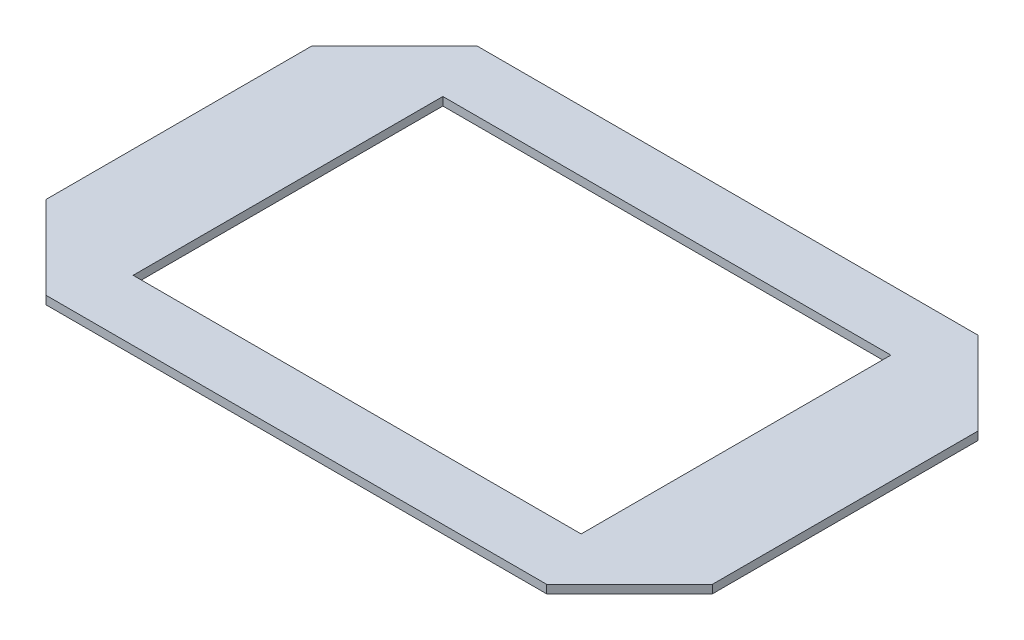
ISO-10303-21;
HEADER;
FILE_DESCRIPTION(('STEP AP214'),'2;1');
FILE_NAME('part.step','',(''),(''),'','','');
FILE_SCHEMA(('AUTOMOTIVE_DESIGN { 1 0 10303 214 1 1 1 1 }'));
ENDSEC;
DATA;
#1=APPLICATION_CONTEXT('core data for automotive mechanical design processes');
#2=APPLICATION_PROTOCOL_DEFINITION('international standard','automotive_design',2000,#1);
#3=PRODUCT_CONTEXT('',#1,'mechanical');
#4=PRODUCT('Part','Part','',(#3));
#5=PRODUCT_RELATED_PRODUCT_CATEGORY('part','',(#4));
#6=PRODUCT_DEFINITION_FORMATION('','',#4);
#7=PRODUCT_DEFINITION_CONTEXT('part definition',#1,'design');
#8=PRODUCT_DEFINITION('design','',#6,#7);
#9=PRODUCT_DEFINITION_SHAPE('','',#8);
#10=(LENGTH_UNIT() NAMED_UNIT(*) SI_UNIT(.MILLI.,.METRE.));
#11=(NAMED_UNIT(*) PLANE_ANGLE_UNIT() SI_UNIT($,.RADIAN.));
#12=(NAMED_UNIT(*) SI_UNIT($,.STERADIAN.) SOLID_ANGLE_UNIT());
#13=UNCERTAINTY_MEASURE_WITH_UNIT(LENGTH_MEASURE(1.E-05),#10,'distance_accuracy_value','');
#14=(GEOMETRIC_REPRESENTATION_CONTEXT(3) GLOBAL_UNCERTAINTY_ASSIGNED_CONTEXT((#13)) GLOBAL_UNIT_ASSIGNED_CONTEXT((#10,
#11,#12)) REPRESENTATION_CONTEXT('',''));
#15=CARTESIAN_POINT('',(0.,0.,0.));
#16=DIRECTION('',(0.,0.,1.));
#17=DIRECTION('',(1.,0.,0.));
#18=AXIS2_PLACEMENT_3D('',#15,#16,#17);
#19=CARTESIAN_POINT('',(60.25,1.5,39.));
#20=DIRECTION('',(-1.,0.,0.));
#21=DIRECTION('',(0.,0.,1.));
#22=AXIS2_PLACEMENT_3D('',#19,#20,#21);
#23=PLANE('',#22);
#24=DIRECTION('',(0.,0.,-1.));
#25=VECTOR('',#24,1.);
#26=CARTESIAN_POINT('',(60.25,0.,39.));
#27=LINE('',#26,#25);
#28=CARTESIAN_POINT('',(60.25,0.,24.));
#29=VERTEX_POINT('',#28);
#30=CARTESIAN_POINT('',(60.25,0.,-23.9999999999999));
#31=VERTEX_POINT('',#30);
#32=EDGE_CURVE('E146',#29,#31,#27,.T.);
#33=ORIENTED_EDGE('',*,*,#32,.T.);
#34=DIRECTION('',(0.,1.,0.));
#35=VECTOR('',#34,1.);
#36=CARTESIAN_POINT('',(60.25,1.5,-23.9999999999999));
#37=LINE('',#36,#35);
#38=CARTESIAN_POINT('',(60.25,1.5,-23.9999999999999));
#39=VERTEX_POINT('',#38);
#40=EDGE_CURVE('E201',#31,#39,#37,.T.);
#41=ORIENTED_EDGE('',*,*,#40,.T.);
#42=DIRECTION('',(0.,0.,-1.));
#43=VECTOR('',#42,1.);
#44=CARTESIAN_POINT('',(60.25,1.5,39.));
#45=LINE('',#44,#43);
#46=CARTESIAN_POINT('',(60.25,1.5,24.));
#47=VERTEX_POINT('',#46);
#48=EDGE_CURVE('E149',#47,#39,#45,.T.);
#49=ORIENTED_EDGE('',*,*,#48,.F.);
#50=DIRECTION('',(0.,-1.,0.));
#51=VECTOR('',#50,1.);
#52=CARTESIAN_POINT('',(60.25,1.5,24.));
#53=LINE('',#52,#51);
#54=EDGE_CURVE('E198',#47,#29,#53,.T.);
#55=ORIENTED_EDGE('',*,*,#54,.T.);
#56=EDGE_LOOP('',(#33,#41,#49,#55));
#57=FACE_BOUND('',#56,.T.);
#58=ADVANCED_FACE('F32',(#57),#23,.F.);
#59=CARTESIAN_POINT('',(-60.25,1.5,-39.));
#60=DIRECTION('',(0.,0.,1.));
#61=DIRECTION('',(1.,0.,0.));
#62=AXIS2_PLACEMENT_3D('',#59,#60,#61);
#63=PLANE('',#62);
#64=DIRECTION('',(-1.,0.,0.));
#65=VECTOR('',#64,1.);
#66=CARTESIAN_POINT('',(-60.25,0.,-39.));
#67=LINE('',#66,#65);
#68=CARTESIAN_POINT('',(45.25,0.,-39.));
#69=VERTEX_POINT('',#68);
#70=CARTESIAN_POINT('',(-45.2499999999999,0.,-39.));
#71=VERTEX_POINT('',#70);
#72=EDGE_CURVE('E165',#69,#71,#67,.T.);
#73=ORIENTED_EDGE('',*,*,#72,.T.);
#74=DIRECTION('',(0.,1.,0.));
#75=VECTOR('',#74,1.);
#76=CARTESIAN_POINT('',(-45.2499999999999,1.5,-39.));
#77=LINE('',#76,#75);
#78=CARTESIAN_POINT('',(-45.2499999999999,1.5,-39.));
#79=VERTEX_POINT('',#78);
#80=EDGE_CURVE('E188',#71,#79,#77,.T.);
#81=ORIENTED_EDGE('',*,*,#80,.T.);
#82=DIRECTION('',(-1.,0.,0.));
#83=VECTOR('',#82,1.);
#84=CARTESIAN_POINT('',(-60.25,1.5,-39.));
#85=LINE('',#84,#83);
#86=CARTESIAN_POINT('',(45.25,1.5,-39.));
#87=VERTEX_POINT('',#86);
#88=EDGE_CURVE('E152',#87,#79,#85,.T.);
#89=ORIENTED_EDGE('',*,*,#88,.F.);
#90=DIRECTION('',(0.,-1.,0.));
#91=VECTOR('',#90,1.);
#92=CARTESIAN_POINT('',(45.25,1.5,-39.));
#93=LINE('',#92,#91);
#94=EDGE_CURVE('E185',#87,#69,#93,.T.);
#95=ORIENTED_EDGE('',*,*,#94,.T.);
#96=EDGE_LOOP('',(#73,#81,#89,#95));
#97=FACE_BOUND('',#96,.T.);
#98=ADVANCED_FACE('F231',(#97),#63,.F.);
#99=CARTESIAN_POINT('',(-60.25,1.5,39.));
#100=DIRECTION('',(1.,0.,0.));
#101=DIRECTION('',(0.,0.,-1.));
#102=AXIS2_PLACEMENT_3D('',#99,#100,#101);
#103=PLANE('',#102);
#104=DIRECTION('',(0.,0.,1.));
#105=VECTOR('',#104,1.);
#106=CARTESIAN_POINT('',(-60.25,1.5,39.));
#107=LINE('',#106,#105);
#108=CARTESIAN_POINT('',(-60.25,1.5,-24.));
#109=VERTEX_POINT('',#108);
#110=CARTESIAN_POINT('',(-60.25,1.5,23.9999999999999));
#111=VERTEX_POINT('',#110);
#112=EDGE_CURVE('E156',#109,#111,#107,.T.);
#113=ORIENTED_EDGE('',*,*,#112,.F.);
#114=DIRECTION('',(0.,-1.,0.));
#115=VECTOR('',#114,1.);
#116=CARTESIAN_POINT('',(-60.25,1.5,-24.));
#117=LINE('',#116,#115);
#118=CARTESIAN_POINT('',(-60.25,0.,-24.));
#119=VERTEX_POINT('',#118);
#120=EDGE_CURVE('E174',#109,#119,#117,.T.);
#121=ORIENTED_EDGE('',*,*,#120,.T.);
#122=DIRECTION('',(0.,0.,1.));
#123=VECTOR('',#122,1.);
#124=CARTESIAN_POINT('',(-60.25,0.,39.));
#125=LINE('',#124,#123);
#126=CARTESIAN_POINT('',(-60.25,0.,23.9999999999999));
#127=VERTEX_POINT('',#126);
#128=EDGE_CURVE('E168',#119,#127,#125,.T.);
#129=ORIENTED_EDGE('',*,*,#128,.T.);
#130=DIRECTION('',(0.,1.,0.));
#131=VECTOR('',#130,1.);
#132=CARTESIAN_POINT('',(-60.25,1.5,23.9999999999999));
#133=LINE('',#132,#131);
#134=EDGE_CURVE('E162',#127,#111,#133,.T.);
#135=ORIENTED_EDGE('',*,*,#134,.T.);
#136=EDGE_LOOP('',(#113,#121,#129,#135));
#137=FACE_BOUND('',#136,.T.);
#138=ADVANCED_FACE('F237',(#137),#103,.F.);
#139=CARTESIAN_POINT('',(-60.25,1.5,39.));
#140=DIRECTION('',(0.,0.,-1.));
#141=DIRECTION('',(-1.,0.,0.));
#142=AXIS2_PLACEMENT_3D('',#139,#140,#141);
#143=PLANE('',#142);
#144=DIRECTION('',(1.,0.,0.));
#145=VECTOR('',#144,1.);
#146=CARTESIAN_POINT('',(-60.25,0.,39.));
#147=LINE('',#146,#145);
#148=CARTESIAN_POINT('',(-45.25,0.,39.));
#149=VERTEX_POINT('',#148);
#150=CARTESIAN_POINT('',(45.2499999999999,0.,39.));
#151=VERTEX_POINT('',#150);
#152=EDGE_CURVE('E153',#149,#151,#147,.T.);
#153=ORIENTED_EDGE('',*,*,#152,.T.);
#154=DIRECTION('',(0.,1.,0.));
#155=VECTOR('',#154,1.);
#156=CARTESIAN_POINT('',(45.2499999999999,1.5,39.));
#157=LINE('',#156,#155);
#158=CARTESIAN_POINT('',(45.2499999999999,1.5,39.));
#159=VERTEX_POINT('',#158);
#160=EDGE_CURVE('E206',#151,#159,#157,.T.);
#161=ORIENTED_EDGE('',*,*,#160,.T.);
#162=DIRECTION('',(1.,0.,0.));
#163=VECTOR('',#162,1.);
#164=CARTESIAN_POINT('',(-60.25,1.5,39.));
#165=LINE('',#164,#163);
#166=CARTESIAN_POINT('',(-45.25,1.5,39.));
#167=VERTEX_POINT('',#166);
#168=EDGE_CURVE('E159',#167,#159,#165,.T.);
#169=ORIENTED_EDGE('',*,*,#168,.F.);
#170=DIRECTION('',(0.,-1.,0.));
#171=VECTOR('',#170,1.);
#172=CARTESIAN_POINT('',(-45.25,1.5,39.));
#173=LINE('',#172,#171);
#174=EDGE_CURVE('E203',#167,#149,#173,.T.);
#175=ORIENTED_EDGE('',*,*,#174,.T.);
#176=EDGE_LOOP('',(#153,#161,#169,#175));
#177=FACE_BOUND('',#176,.T.);
#178=ADVANCED_FACE('F274',(#177),#143,.F.);
#179=CARTESIAN_POINT('',(0.,1.5,0.));
#180=DIRECTION('',(0.,-1.,0.));
#181=DIRECTION('',(0.,0.,-1.));
#182=AXIS2_PLACEMENT_3D('',#179,#180,#181);
#183=PLANE('',#182);
#184=DIRECTION('',(-1.,0.,0.));
#185=VECTOR('',#184,1.);
#186=CARTESIAN_POINT('',(-40.5,1.5,-28.));
#187=LINE('',#186,#185);
#188=CARTESIAN_POINT('',(40.5,1.5,-28.));
#189=VERTEX_POINT('',#188);
#190=CARTESIAN_POINT('',(-40.5,1.5,-28.));
#191=VERTEX_POINT('',#190);
#192=EDGE_CURVE('E132',#189,#191,#187,.T.);
#193=ORIENTED_EDGE('',*,*,#192,.F.);
#194=DIRECTION('',(0.,0.,-1.));
#195=VECTOR('',#194,1.);
#196=CARTESIAN_POINT('',(40.5,1.5,28.));
#197=LINE('',#196,#195);
#198=CARTESIAN_POINT('',(40.5,1.5,28.));
#199=VERTEX_POINT('',#198);
#200=EDGE_CURVE('E47',#199,#189,#197,.T.);
#201=ORIENTED_EDGE('',*,*,#200,.F.);
#202=DIRECTION('',(1.,0.,0.));
#203=VECTOR('',#202,1.);
#204=CARTESIAN_POINT('',(-40.5,1.5,28.));
#205=LINE('',#204,#203);
#206=CARTESIAN_POINT('',(-40.5,1.5,28.));
#207=VERTEX_POINT('',#206);
#208=EDGE_CURVE('E139',#207,#199,#205,.T.);
#209=ORIENTED_EDGE('',*,*,#208,.F.);
#210=DIRECTION('',(0.,0.,1.));
#211=VECTOR('',#210,1.);
#212=CARTESIAN_POINT('',(-40.5,1.5,28.));
#213=LINE('',#212,#211);
#214=EDGE_CURVE('E123',#191,#207,#213,.T.);
#215=ORIENTED_EDGE('',*,*,#214,.F.);
#216=EDGE_LOOP('',(#193,#201,#209,#215));
#217=FACE_BOUND('',#216,.T.);
#218=ORIENTED_EDGE('',*,*,#88,.T.);
#219=DIRECTION('',(0.70710678118655,0.,-0.707106781186546));
#220=VECTOR('',#219,1.);
#221=CARTESIAN_POINT('',(-60.25,1.5,-24.));
#222=LINE('',#221,#220);
#223=EDGE_CURVE('E196',#79,#109,#222,.F.);
#224=ORIENTED_EDGE('',*,*,#223,.T.);
#225=ORIENTED_EDGE('',*,*,#112,.T.);
#226=DIRECTION('',(-0.707106781186546,0.,-0.70710678118655));
#227=VECTOR('',#226,1.);
#228=CARTESIAN_POINT('',(-45.25,1.5,39.));
#229=LINE('',#228,#227);
#230=EDGE_CURVE('E190',#111,#167,#229,.F.);
#231=ORIENTED_EDGE('',*,*,#230,.T.);
#232=ORIENTED_EDGE('',*,*,#168,.T.);
#233=DIRECTION('',(-0.70710678118655,0.,0.707106781186546));
#234=VECTOR('',#233,1.);
#235=CARTESIAN_POINT('',(60.25,1.5,24.));
#236=LINE('',#235,#234);
#237=EDGE_CURVE('E192',#159,#47,#236,.F.);
#238=ORIENTED_EDGE('',*,*,#237,.T.);
#239=ORIENTED_EDGE('',*,*,#48,.T.);
#240=DIRECTION('',(0.707106781186546,0.,0.70710678118655));
#241=VECTOR('',#240,1.);
#242=CARTESIAN_POINT('',(45.25,1.5,-39.));
#243=LINE('',#242,#241);
#244=EDGE_CURVE('E194',#39,#87,#243,.F.);
#245=ORIENTED_EDGE('',*,*,#244,.T.);
#246=EDGE_LOOP('',(#218,#224,#225,#231,#232,#238,#239,#245));
#247=FACE_BOUND('',#246,.T.);
#248=ADVANCED_FACE('F136',(#217,#247),#183,.F.);
#249=CARTESIAN_POINT('',(0.,0.,0.));
#250=DIRECTION('',(0.,-1.,0.));
#251=DIRECTION('',(0.,0.,-1.));
#252=AXIS2_PLACEMENT_3D('',#249,#250,#251);
#253=PLANE('',#252);
#254=DIRECTION('',(0.,0.,1.));
#255=VECTOR('',#254,1.);
#256=CARTESIAN_POINT('',(40.5,0.,0.));
#257=LINE('',#256,#255);
#258=CARTESIAN_POINT('',(40.5,0.,-28.));
#259=VERTEX_POINT('',#258);
#260=CARTESIAN_POINT('',(40.5,0.,28.));
#261=VERTEX_POINT('',#260);
#262=EDGE_CURVE('E11',#259,#261,#257,.T.);
#263=ORIENTED_EDGE('',*,*,#262,.F.);
#264=DIRECTION('',(1.,0.,0.));
#265=VECTOR('',#264,1.);
#266=CARTESIAN_POINT('',(0.,0.,-28.));
#267=LINE('',#266,#265);
#268=CARTESIAN_POINT('',(-40.5,0.,-28.));
#269=VERTEX_POINT('',#268);
#270=EDGE_CURVE('E208',#269,#259,#267,.T.);
#271=ORIENTED_EDGE('',*,*,#270,.F.);
#272=DIRECTION('',(0.,0.,-1.));
#273=VECTOR('',#272,1.);
#274=CARTESIAN_POINT('',(-40.5,0.,0.));
#275=LINE('',#274,#273);
#276=CARTESIAN_POINT('',(-40.5,0.,28.));
#277=VERTEX_POINT('',#276);
#278=EDGE_CURVE('E126',#277,#269,#275,.T.);
#279=ORIENTED_EDGE('',*,*,#278,.F.);
#280=DIRECTION('',(-1.,0.,0.));
#281=VECTOR('',#280,1.);
#282=CARTESIAN_POINT('',(0.,0.,28.));
#283=LINE('',#282,#281);
#284=EDGE_CURVE('E40',#261,#277,#283,.T.);
#285=ORIENTED_EDGE('',*,*,#284,.F.);
#286=EDGE_LOOP('',(#263,#271,#279,#285));
#287=FACE_BOUND('',#286,.T.);
#288=ORIENTED_EDGE('',*,*,#128,.F.);
#289=DIRECTION('',(-0.70710678118655,0.,0.707106781186546));
#290=VECTOR('',#289,1.);
#291=CARTESIAN_POINT('',(-42.1249999999998,0.,-42.1250000000001));
#292=LINE('',#291,#290);
#293=EDGE_CURVE('E183',#119,#71,#292,.F.);
#294=ORIENTED_EDGE('',*,*,#293,.T.);
#295=ORIENTED_EDGE('',*,*,#72,.F.);
#296=DIRECTION('',(-0.707106781186546,0.,-0.70710678118655));
#297=VECTOR('',#296,1.);
#298=CARTESIAN_POINT('',(42.1250000000001,0.,-42.1249999999999));
#299=LINE('',#298,#297);
#300=EDGE_CURVE('E181',#69,#31,#299,.F.);
#301=ORIENTED_EDGE('',*,*,#300,.T.);
#302=ORIENTED_EDGE('',*,*,#32,.F.);
#303=DIRECTION('',(0.70710678118655,0.,-0.707106781186546));
#304=VECTOR('',#303,1.);
#305=CARTESIAN_POINT('',(42.1249999999998,0.,42.1250000000001));
#306=LINE('',#305,#304);
#307=EDGE_CURVE('E179',#29,#151,#306,.F.);
#308=ORIENTED_EDGE('',*,*,#307,.T.);
#309=ORIENTED_EDGE('',*,*,#152,.F.);
#310=DIRECTION('',(0.707106781186546,0.,0.70710678118655));
#311=VECTOR('',#310,1.);
#312=CARTESIAN_POINT('',(-42.1250000000001,0.,42.1249999999999));
#313=LINE('',#312,#311);
#314=EDGE_CURVE('E177',#149,#127,#313,.F.);
#315=ORIENTED_EDGE('',*,*,#314,.T.);
#316=EDGE_LOOP('',(#288,#294,#295,#301,#302,#308,#309,#315));
#317=FACE_BOUND('',#316,.T.);
#318=ADVANCED_FACE('F216',(#287,#317),#253,.T.);
#319=CARTESIAN_POINT('',(-60.25,1.5,-24.));
#320=DIRECTION('',(0.707106781186545,0.,0.707106781186549));
#321=DIRECTION('',(0.,-1.,0.));
#322=AXIS2_PLACEMENT_3D('',#319,#320,#321);
#323=PLANE('',#322);
#324=ORIENTED_EDGE('',*,*,#223,.F.);
#325=ORIENTED_EDGE('',*,*,#80,.F.);
#326=ORIENTED_EDGE('',*,*,#293,.F.);
#327=ORIENTED_EDGE('',*,*,#120,.F.);
#328=EDGE_LOOP('',(#324,#325,#326,#327));
#329=FACE_BOUND('',#328,.T.);
#330=ADVANCED_FACE('F242',(#329),#323,.F.);
#331=CARTESIAN_POINT('',(45.25,1.5,-39.));
#332=DIRECTION('',(-0.707106781186549,0.,0.707106781186545));
#333=DIRECTION('',(0.,-1.,0.));
#334=AXIS2_PLACEMENT_3D('',#331,#332,#333);
#335=PLANE('',#334);
#336=ORIENTED_EDGE('',*,*,#244,.F.);
#337=ORIENTED_EDGE('',*,*,#40,.F.);
#338=ORIENTED_EDGE('',*,*,#300,.F.);
#339=ORIENTED_EDGE('',*,*,#94,.F.);
#340=EDGE_LOOP('',(#336,#337,#338,#339));
#341=FACE_BOUND('',#340,.T.);
#342=ADVANCED_FACE('F245',(#341),#335,.F.);
#343=CARTESIAN_POINT('',(60.25,1.5,24.));
#344=DIRECTION('',(-0.707106781186545,0.,-0.707106781186549));
#345=DIRECTION('',(0.,-1.,0.));
#346=AXIS2_PLACEMENT_3D('',#343,#344,#345);
#347=PLANE('',#346);
#348=ORIENTED_EDGE('',*,*,#237,.F.);
#349=ORIENTED_EDGE('',*,*,#160,.F.);
#350=ORIENTED_EDGE('',*,*,#307,.F.);
#351=ORIENTED_EDGE('',*,*,#54,.F.);
#352=EDGE_LOOP('',(#348,#349,#350,#351));
#353=FACE_BOUND('',#352,.T.);
#354=ADVANCED_FACE('F226',(#353),#347,.F.);
#355=CARTESIAN_POINT('',(-45.25,1.5,39.));
#356=DIRECTION('',(0.707106781186549,0.,-0.707106781186545));
#357=DIRECTION('',(0.,-1.,0.));
#358=AXIS2_PLACEMENT_3D('',#355,#356,#357);
#359=PLANE('',#358);
#360=ORIENTED_EDGE('',*,*,#230,.F.);
#361=ORIENTED_EDGE('',*,*,#134,.F.);
#362=ORIENTED_EDGE('',*,*,#314,.F.);
#363=ORIENTED_EDGE('',*,*,#174,.F.);
#364=EDGE_LOOP('',(#360,#361,#362,#363));
#365=FACE_BOUND('',#364,.T.);
#366=ADVANCED_FACE('F34',(#365),#359,.F.);
#367=CARTESIAN_POINT('',(40.5,-0.5,28.));
#368=DIRECTION('',(1.,0.,0.));
#369=DIRECTION('',(0.,0.,-1.));
#370=AXIS2_PLACEMENT_3D('',#367,#368,#369);
#371=PLANE('',#370);
#372=ORIENTED_EDGE('',*,*,#262,.T.);
#373=DIRECTION('',(0.,1.,0.));
#374=VECTOR('',#373,1.);
#375=CARTESIAN_POINT('',(40.5,-0.5,28.));
#376=LINE('',#375,#374);
#377=EDGE_CURVE('E144',#261,#199,#376,.T.);
#378=ORIENTED_EDGE('',*,*,#377,.T.);
#379=ORIENTED_EDGE('',*,*,#200,.T.);
#380=DIRECTION('',(0.,1.,0.));
#381=VECTOR('',#380,1.);
#382=CARTESIAN_POINT('',(40.5,-0.5,-28.));
#383=LINE('',#382,#381);
#384=EDGE_CURVE('E129',#259,#189,#383,.T.);
#385=ORIENTED_EDGE('',*,*,#384,.F.);
#386=EDGE_LOOP('',(#372,#378,#379,#385));
#387=FACE_BOUND('',#386,.T.);
#388=ADVANCED_FACE('F218',(#387),#371,.F.);
#389=CARTESIAN_POINT('',(-40.5,-0.5,28.));
#390=DIRECTION('',(0.,0.,1.));
#391=DIRECTION('',(1.,0.,0.));
#392=AXIS2_PLACEMENT_3D('',#389,#390,#391);
#393=PLANE('',#392);
#394=ORIENTED_EDGE('',*,*,#284,.T.);
#395=DIRECTION('',(0.,1.,0.));
#396=VECTOR('',#395,1.);
#397=CARTESIAN_POINT('',(-40.5,-0.5,28.));
#398=LINE('',#397,#396);
#399=EDGE_CURVE('E128',#277,#207,#398,.T.);
#400=ORIENTED_EDGE('',*,*,#399,.T.);
#401=ORIENTED_EDGE('',*,*,#208,.T.);
#402=ORIENTED_EDGE('',*,*,#377,.F.);
#403=EDGE_LOOP('',(#394,#400,#401,#402));
#404=FACE_BOUND('',#403,.T.);
#405=ADVANCED_FACE('F213',(#404),#393,.F.);
#406=CARTESIAN_POINT('',(-40.5,-0.5,28.));
#407=DIRECTION('',(-1.,0.,0.));
#408=DIRECTION('',(0.,0.,1.));
#409=AXIS2_PLACEMENT_3D('',#406,#407,#408);
#410=PLANE('',#409);
#411=ORIENTED_EDGE('',*,*,#278,.T.);
#412=DIRECTION('',(0.,1.,0.));
#413=VECTOR('',#412,1.);
#414=CARTESIAN_POINT('',(-40.5,-0.5,-28.));
#415=LINE('',#414,#413);
#416=EDGE_CURVE('E55',#269,#191,#415,.T.);
#417=ORIENTED_EDGE('',*,*,#416,.T.);
#418=ORIENTED_EDGE('',*,*,#214,.T.);
#419=ORIENTED_EDGE('',*,*,#399,.F.);
#420=EDGE_LOOP('',(#411,#417,#418,#419));
#421=FACE_BOUND('',#420,.T.);
#422=ADVANCED_FACE('F120',(#421),#410,.F.);
#423=CARTESIAN_POINT('',(-40.5,-0.5,-28.));
#424=DIRECTION('',(0.,0.,-1.));
#425=DIRECTION('',(-1.,0.,0.));
#426=AXIS2_PLACEMENT_3D('',#423,#424,#425);
#427=PLANE('',#426);
#428=ORIENTED_EDGE('',*,*,#270,.T.);
#429=ORIENTED_EDGE('',*,*,#384,.T.);
#430=ORIENTED_EDGE('',*,*,#192,.T.);
#431=ORIENTED_EDGE('',*,*,#416,.F.);
#432=EDGE_LOOP('',(#428,#429,#430,#431));
#433=FACE_BOUND('',#432,.T.);
#434=ADVANCED_FACE('F133',(#433),#427,.F.);
#435=CLOSED_SHELL('',(#58,#98,#138,#178,#248,#318,#330,#342,#354,#366,#388,#405,#422,#434));
#436=MANIFOLD_SOLID_BREP('B2',#435);
#437=ADVANCED_BREP_SHAPE_REPRESENTATION('',(#18,#436),#14);
#438=SHAPE_DEFINITION_REPRESENTATION(#9,#437);
ENDSEC;
END-ISO-10303-21;
